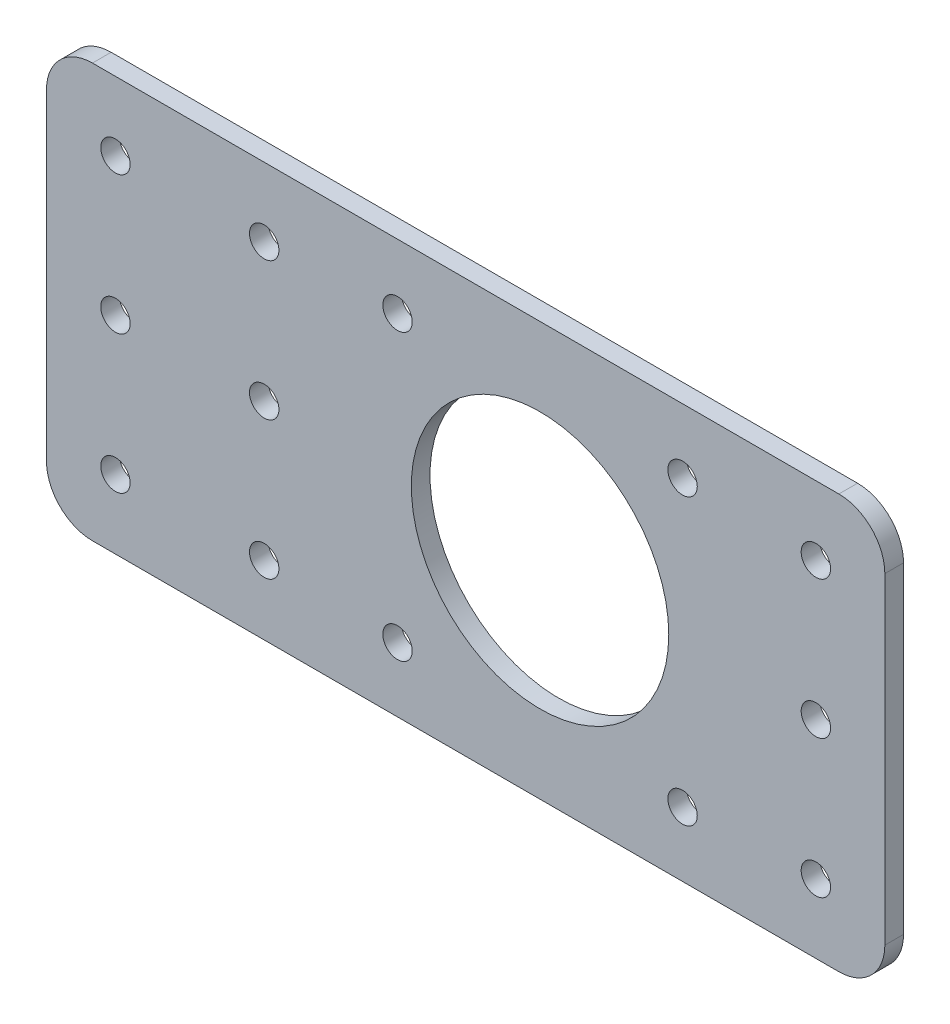
ISO-10303-21;
HEADER;
FILE_DESCRIPTION(('STEP AP214'),'2;1');
FILE_NAME('part.step','',(''),(''),'','','');
FILE_SCHEMA(('AUTOMOTIVE_DESIGN { 1 0 10303 214 1 1 1 1 }'));
ENDSEC;
DATA;
#1=APPLICATION_CONTEXT('core data for automotive mechanical design processes');
#2=APPLICATION_PROTOCOL_DEFINITION('international standard','automotive_design',2000,#1);
#3=PRODUCT_CONTEXT('',#1,'mechanical');
#4=PRODUCT('Part','Part','',(#3));
#5=PRODUCT_RELATED_PRODUCT_CATEGORY('part','',(#4));
#6=PRODUCT_DEFINITION_FORMATION('','',#4);
#7=PRODUCT_DEFINITION_CONTEXT('part definition',#1,'design');
#8=PRODUCT_DEFINITION('design','',#6,#7);
#9=PRODUCT_DEFINITION_SHAPE('','',#8);
#10=(LENGTH_UNIT() NAMED_UNIT(*) SI_UNIT(.MILLI.,.METRE.));
#11=(NAMED_UNIT(*) PLANE_ANGLE_UNIT() SI_UNIT($,.RADIAN.));
#12=(NAMED_UNIT(*) SI_UNIT($,.STERADIAN.) SOLID_ANGLE_UNIT());
#13=UNCERTAINTY_MEASURE_WITH_UNIT(LENGTH_MEASURE(1.E-05),#10,'distance_accuracy_value','');
#14=(GEOMETRIC_REPRESENTATION_CONTEXT(3) GLOBAL_UNCERTAINTY_ASSIGNED_CONTEXT((#13)) GLOBAL_UNIT_ASSIGNED_CONTEXT((#10,
#11,#12)) REPRESENTATION_CONTEXT('',''));
#15=CARTESIAN_POINT('',(0.,0.,0.));
#16=DIRECTION('',(0.,0.,1.));
#17=DIRECTION('',(1.,0.,0.));
#18=AXIS2_PLACEMENT_3D('',#15,#16,#17);
#19=CARTESIAN_POINT('',(0.,0.,2.032));
#20=DIRECTION('',(0.,0.,-1.));
#21=DIRECTION('',(-1.,0.,0.));
#22=AXIS2_PLACEMENT_3D('',#19,#20,#21);
#23=PLANE('',#22);
#24=CARTESIAN_POINT('',(-46.18,-15.,2.032));
#25=DIRECTION('',(0.,0.,1.));
#26=DIRECTION('',(1.,0.,0.));
#27=AXIS2_PLACEMENT_3D('',#24,#25,#26);
#28=CIRCLE('',#27,1.6);
#29=CARTESIAN_POINT('',(-44.58,-15.,2.032));
#30=VERTEX_POINT('',#29);
#31=EDGE_CURVE('E255',#30,#30,#28,.T.);
#32=ORIENTED_EDGE('',*,*,#31,.F.);
#33=EDGE_LOOP('',(#32));
#34=FACE_BOUND('',#33,.T.);
#35=CARTESIAN_POINT('',(-46.18,0.,2.032));
#36=DIRECTION('',(0.,0.,1.));
#37=DIRECTION('',(1.,0.,0.));
#38=AXIS2_PLACEMENT_3D('',#35,#36,#37);
#39=CIRCLE('',#38,1.6);
#40=CARTESIAN_POINT('',(-44.58,0.,2.032));
#41=VERTEX_POINT('',#40);
#42=EDGE_CURVE('E249',#41,#41,#39,.T.);
#43=ORIENTED_EDGE('',*,*,#42,.F.);
#44=EDGE_LOOP('',(#43));
#45=FACE_BOUND('',#44,.T.);
#46=CARTESIAN_POINT('',(-46.18,15.,2.032));
#47=DIRECTION('',(0.,0.,1.));
#48=DIRECTION('',(1.,0.,0.));
#49=AXIS2_PLACEMENT_3D('',#46,#47,#48);
#50=CIRCLE('',#49,1.6);
#51=CARTESIAN_POINT('',(-44.58,15.,2.032));
#52=VERTEX_POINT('',#51);
#53=EDGE_CURVE('E243',#52,#52,#50,.T.);
#54=ORIENTED_EDGE('',*,*,#53,.F.);
#55=EDGE_LOOP('',(#54));
#56=FACE_BOUND('',#55,.T.);
#57=CARTESIAN_POINT('',(30.,0.,2.032));
#58=DIRECTION('',(0.,0.,1.));
#59=DIRECTION('',(-1.,0.,0.));
#60=AXIS2_PLACEMENT_3D('',#57,#58,#59);
#61=CIRCLE('',#60,1.60000000000001);
#62=CARTESIAN_POINT('',(28.4,0.,2.032));
#63=VERTEX_POINT('',#62);
#64=EDGE_CURVE('E164',#63,#63,#61,.T.);
#65=ORIENTED_EDGE('',*,*,#64,.F.);
#66=EDGE_LOOP('',(#65));
#67=FACE_BOUND('',#66,.T.);
#68=CARTESIAN_POINT('',(30.,15.,2.032));
#69=DIRECTION('',(0.,0.,1.));
#70=DIRECTION('',(-1.,0.,0.));
#71=AXIS2_PLACEMENT_3D('',#68,#69,#70);
#72=CIRCLE('',#71,1.6);
#73=CARTESIAN_POINT('',(28.4,15.,2.032));
#74=VERTEX_POINT('',#73);
#75=EDGE_CURVE('E231',#74,#74,#72,.T.);
#76=ORIENTED_EDGE('',*,*,#75,.F.);
#77=EDGE_LOOP('',(#76));
#78=FACE_BOUND('',#77,.T.);
#79=CARTESIAN_POINT('',(30.,-15.,2.032));
#80=DIRECTION('',(0.,0.,1.));
#81=DIRECTION('',(1.,0.,0.));
#82=AXIS2_PLACEMENT_3D('',#79,#80,#81);
#83=CIRCLE('',#82,1.60000000000001);
#84=CARTESIAN_POINT('',(31.6,-15.,2.032));
#85=VERTEX_POINT('',#84);
#86=EDGE_CURVE('E225',#85,#85,#83,.T.);
#87=ORIENTED_EDGE('',*,*,#86,.F.);
#88=EDGE_LOOP('',(#87));
#89=FACE_BOUND('',#88,.T.);
#90=CARTESIAN_POINT('',(-30.,-15.,2.032));
#91=DIRECTION('',(0.,0.,1.));
#92=DIRECTION('',(-1.,0.,0.));
#93=AXIS2_PLACEMENT_3D('',#90,#91,#92);
#94=CIRCLE('',#93,1.6);
#95=CARTESIAN_POINT('',(-31.6,-15.,2.032));
#96=VERTEX_POINT('',#95);
#97=EDGE_CURVE('E219',#96,#96,#94,.T.);
#98=ORIENTED_EDGE('',*,*,#97,.F.);
#99=EDGE_LOOP('',(#98));
#100=FACE_BOUND('',#99,.T.);
#101=CARTESIAN_POINT('',(-30.,15.,2.032));
#102=DIRECTION('',(0.,0.,1.));
#103=DIRECTION('',(1.,0.,0.));
#104=AXIS2_PLACEMENT_3D('',#101,#102,#103);
#105=CIRCLE('',#104,1.6);
#106=CARTESIAN_POINT('',(-28.4,15.,2.032));
#107=VERTEX_POINT('',#106);
#108=EDGE_CURVE('E213',#107,#107,#105,.T.);
#109=ORIENTED_EDGE('',*,*,#108,.F.);
#110=EDGE_LOOP('',(#109));
#111=FACE_BOUND('',#110,.T.);
#112=CARTESIAN_POINT('',(-30.,0.,2.032));
#113=DIRECTION('',(0.,0.,1.));
#114=DIRECTION('',(1.,0.,0.));
#115=AXIS2_PLACEMENT_3D('',#112,#113,#114);
#116=CIRCLE('',#115,1.60000000000001);
#117=CARTESIAN_POINT('',(-28.4,0.,2.032));
#118=VERTEX_POINT('',#117);
#119=EDGE_CURVE('E207',#118,#118,#116,.T.);
#120=ORIENTED_EDGE('',*,*,#119,.F.);
#121=EDGE_LOOP('',(#120));
#122=FACE_BOUND('',#121,.T.);
#123=CARTESIAN_POINT('',(15.5,-15.5,2.032));
#124=DIRECTION('',(0.,0.,1.));
#125=DIRECTION('',(1.,0.,0.));
#126=AXIS2_PLACEMENT_3D('',#123,#124,#125);
#127=CIRCLE('',#126,1.6);
#128=CARTESIAN_POINT('',(17.1,-15.5,2.032));
#129=VERTEX_POINT('',#128);
#130=EDGE_CURVE('E192',#129,#129,#127,.T.);
#131=ORIENTED_EDGE('',*,*,#130,.F.);
#132=EDGE_LOOP('',(#131));
#133=FACE_BOUND('',#132,.T.);
#134=CARTESIAN_POINT('',(-15.5,15.5,2.032));
#135=DIRECTION('',(0.,0.,1.));
#136=DIRECTION('',(1.,0.,0.));
#137=AXIS2_PLACEMENT_3D('',#134,#135,#136);
#138=CIRCLE('',#137,1.6);
#139=CARTESIAN_POINT('',(-13.9,15.5,2.032));
#140=VERTEX_POINT('',#139);
#141=EDGE_CURVE('E180',#140,#140,#138,.T.);
#142=ORIENTED_EDGE('',*,*,#141,.F.);
#143=EDGE_LOOP('',(#142));
#144=FACE_BOUND('',#143,.T.);
#145=DIRECTION('',(0.,-1.,0.));
#146=VECTOR('',#145,1.);
#147=CARTESIAN_POINT('',(-53.68,22.5,2.032));
#148=LINE('',#147,#146);
#149=CARTESIAN_POINT('',(-53.68,17.5,2.032));
#150=VERTEX_POINT('',#149);
#151=CARTESIAN_POINT('',(-53.68,-17.5,2.032));
#152=VERTEX_POINT('',#151);
#153=EDGE_CURVE('E165',#150,#152,#148,.T.);
#154=ORIENTED_EDGE('',*,*,#153,.T.);
#155=CARTESIAN_POINT('',(-48.68,-17.5,2.032));
#156=DIRECTION('',(0.,0.,-1.));
#157=DIRECTION('',(-1.,0.,0.));
#158=AXIS2_PLACEMENT_3D('',#155,#156,#157);
#159=CIRCLE('',#158,5.);
#160=CARTESIAN_POINT('',(-48.68,-22.5,2.032));
#161=VERTEX_POINT('',#160);
#162=EDGE_CURVE('E151',#152,#161,#159,.F.);
#163=ORIENTED_EDGE('',*,*,#162,.T.);
#164=DIRECTION('',(1.,0.,0.));
#165=VECTOR('',#164,1.);
#166=CARTESIAN_POINT('',(-37.5,-22.5,2.032));
#167=LINE('',#166,#165);
#168=CARTESIAN_POINT('',(32.5,-22.5,2.032));
#169=VERTEX_POINT('',#168);
#170=EDGE_CURVE('E119',#161,#169,#167,.T.);
#171=ORIENTED_EDGE('',*,*,#170,.T.);
#172=CARTESIAN_POINT('',(32.5,-17.5,2.032));
#173=DIRECTION('',(0.,0.,-1.));
#174=DIRECTION('',(-1.,0.,0.));
#175=AXIS2_PLACEMENT_3D('',#172,#173,#174);
#176=CIRCLE('',#175,5.);
#177=CARTESIAN_POINT('',(37.5,-17.5,2.032));
#178=VERTEX_POINT('',#177);
#179=EDGE_CURVE('E137',#169,#178,#176,.F.);
#180=ORIENTED_EDGE('',*,*,#179,.T.);
#181=DIRECTION('',(0.,1.,0.));
#182=VECTOR('',#181,1.);
#183=CARTESIAN_POINT('',(37.5,-22.5,2.032));
#184=LINE('',#183,#182);
#185=CARTESIAN_POINT('',(37.5,17.5,2.032));
#186=VERTEX_POINT('',#185);
#187=EDGE_CURVE('E126',#178,#186,#184,.T.);
#188=ORIENTED_EDGE('',*,*,#187,.T.);
#189=CARTESIAN_POINT('',(32.5,17.5,2.032));
#190=DIRECTION('',(0.,0.,-1.));
#191=DIRECTION('',(-1.,0.,0.));
#192=AXIS2_PLACEMENT_3D('',#189,#190,#191);
#193=CIRCLE('',#192,5.);
#194=CARTESIAN_POINT('',(32.5,22.5,2.032));
#195=VERTEX_POINT('',#194);
#196=EDGE_CURVE('E139',#186,#195,#193,.F.);
#197=ORIENTED_EDGE('',*,*,#196,.T.);
#198=DIRECTION('',(-1.,0.,0.));
#199=VECTOR('',#198,1.);
#200=CARTESIAN_POINT('',(-37.5,22.5,2.032));
#201=LINE('',#200,#199);
#202=CARTESIAN_POINT('',(-48.68,22.5,2.032));
#203=VERTEX_POINT('',#202);
#204=EDGE_CURVE('E118',#195,#203,#201,.T.);
#205=ORIENTED_EDGE('',*,*,#204,.T.);
#206=CARTESIAN_POINT('',(-48.68,17.5,2.032));
#207=DIRECTION('',(0.,0.,-1.));
#208=DIRECTION('',(-1.,0.,0.));
#209=AXIS2_PLACEMENT_3D('',#206,#207,#208);
#210=CIRCLE('',#209,5.);
#211=EDGE_CURVE('E149',#203,#150,#210,.F.);
#212=ORIENTED_EDGE('',*,*,#211,.T.);
#213=EDGE_LOOP('',(#154,#163,#171,#180,#188,#197,#205,#212));
#214=FACE_BOUND('',#213,.T.);
#215=CARTESIAN_POINT('',(0.,0.,2.032));
#216=DIRECTION('',(0.,0.,1.));
#217=DIRECTION('',(1.,0.,0.));
#218=AXIS2_PLACEMENT_3D('',#215,#216,#217);
#219=CIRCLE('',#218,14.);
#220=CARTESIAN_POINT('',(14.,0.,2.032));
#221=VERTEX_POINT('',#220);
#222=EDGE_CURVE('E128',#221,#221,#219,.T.);
#223=ORIENTED_EDGE('',*,*,#222,.F.);
#224=EDGE_LOOP('',(#223));
#225=FACE_BOUND('',#224,.T.);
#226=CARTESIAN_POINT('',(15.5,15.5,2.032));
#227=DIRECTION('',(0.,0.,1.));
#228=DIRECTION('',(1.,0.,0.));
#229=AXIS2_PLACEMENT_3D('',#226,#227,#228);
#230=CIRCLE('',#229,1.6);
#231=CARTESIAN_POINT('',(17.1,15.5,2.032));
#232=VERTEX_POINT('',#231);
#233=EDGE_CURVE('E186',#232,#232,#230,.T.);
#234=ORIENTED_EDGE('',*,*,#233,.F.);
#235=EDGE_LOOP('',(#234));
#236=FACE_BOUND('',#235,.T.);
#237=CARTESIAN_POINT('',(-15.5,-15.5,2.032));
#238=DIRECTION('',(0.,0.,1.));
#239=DIRECTION('',(1.,0.,0.));
#240=AXIS2_PLACEMENT_3D('',#237,#238,#239);
#241=CIRCLE('',#240,1.6);
#242=CARTESIAN_POINT('',(-13.9,-15.5,2.032));
#243=VERTEX_POINT('',#242);
#244=EDGE_CURVE('E198',#243,#243,#241,.T.);
#245=ORIENTED_EDGE('',*,*,#244,.F.);
#246=EDGE_LOOP('',(#245));
#247=FACE_BOUND('',#246,.T.);
#248=ADVANCED_FACE('F33',(#34,#45,#56,#67,#78,#89,#100,#111,#122,#133,#144,#214,#225,#236,#247),
#23,.F.);
#249=CARTESIAN_POINT('',(0.,0.,0.));
#250=DIRECTION('',(0.,0.,-1.));
#251=DIRECTION('',(-1.,0.,0.));
#252=AXIS2_PLACEMENT_3D('',#249,#250,#251);
#253=PLANE('',#252);
#254=CARTESIAN_POINT('',(-46.18,-15.,0.));
#255=DIRECTION('',(0.,0.,1.));
#256=DIRECTION('',(1.,0.,0.));
#257=AXIS2_PLACEMENT_3D('',#254,#255,#256);
#258=CIRCLE('',#257,1.6);
#259=CARTESIAN_POINT('',(-44.58,-15.,0.));
#260=VERTEX_POINT('',#259);
#261=EDGE_CURVE('E252',#260,#260,#258,.T.);
#262=ORIENTED_EDGE('',*,*,#261,.T.);
#263=EDGE_LOOP('',(#262));
#264=FACE_BOUND('',#263,.T.);
#265=CARTESIAN_POINT('',(-46.18,0.,0.));
#266=DIRECTION('',(0.,0.,1.));
#267=DIRECTION('',(1.,0.,0.));
#268=AXIS2_PLACEMENT_3D('',#265,#266,#267);
#269=CIRCLE('',#268,1.6);
#270=CARTESIAN_POINT('',(-44.58,0.,0.));
#271=VERTEX_POINT('',#270);
#272=EDGE_CURVE('E246',#271,#271,#269,.T.);
#273=ORIENTED_EDGE('',*,*,#272,.T.);
#274=EDGE_LOOP('',(#273));
#275=FACE_BOUND('',#274,.T.);
#276=CARTESIAN_POINT('',(-46.18,15.,0.));
#277=DIRECTION('',(0.,0.,1.));
#278=DIRECTION('',(1.,0.,0.));
#279=AXIS2_PLACEMENT_3D('',#276,#277,#278);
#280=CIRCLE('',#279,1.6);
#281=CARTESIAN_POINT('',(-44.58,15.,0.));
#282=VERTEX_POINT('',#281);
#283=EDGE_CURVE('E242',#282,#282,#280,.T.);
#284=ORIENTED_EDGE('',*,*,#283,.T.);
#285=EDGE_LOOP('',(#284));
#286=FACE_BOUND('',#285,.T.);
#287=DIRECTION('',(1.,0.,0.));
#288=VECTOR('',#287,1.);
#289=CARTESIAN_POINT('',(-37.5,-22.5,0.));
#290=LINE('',#289,#288);
#291=CARTESIAN_POINT('',(-48.68,-22.5,0.));
#292=VERTEX_POINT('',#291);
#293=CARTESIAN_POINT('',(32.5,-22.5,0.));
#294=VERTEX_POINT('',#293);
#295=EDGE_CURVE('E123',#292,#294,#290,.T.);
#296=ORIENTED_EDGE('',*,*,#295,.F.);
#297=CARTESIAN_POINT('',(-48.68,-17.5,0.));
#298=DIRECTION('',(0.,0.,-1.));
#299=DIRECTION('',(-1.,0.,0.));
#300=AXIS2_PLACEMENT_3D('',#297,#298,#299);
#301=CIRCLE('',#300,5.);
#302=CARTESIAN_POINT('',(-53.68,-17.5,0.));
#303=VERTEX_POINT('',#302);
#304=EDGE_CURVE('E41',#292,#303,#301,.T.);
#305=ORIENTED_EDGE('',*,*,#304,.T.);
#306=DIRECTION('',(0.,-1.,0.));
#307=VECTOR('',#306,1.);
#308=CARTESIAN_POINT('',(-53.68,22.5,0.));
#309=LINE('',#308,#307);
#310=CARTESIAN_POINT('',(-53.68,17.5,0.));
#311=VERTEX_POINT('',#310);
#312=EDGE_CURVE('E156',#311,#303,#309,.T.);
#313=ORIENTED_EDGE('',*,*,#312,.F.);
#314=CARTESIAN_POINT('',(-48.68,17.5,0.));
#315=DIRECTION('',(0.,0.,-1.));
#316=DIRECTION('',(-1.,0.,0.));
#317=AXIS2_PLACEMENT_3D('',#314,#315,#316);
#318=CIRCLE('',#317,5.);
#319=CARTESIAN_POINT('',(-48.68,22.5,0.));
#320=VERTEX_POINT('',#319);
#321=EDGE_CURVE('E48',#311,#320,#318,.T.);
#322=ORIENTED_EDGE('',*,*,#321,.T.);
#323=DIRECTION('',(-1.,0.,0.));
#324=VECTOR('',#323,1.);
#325=CARTESIAN_POINT('',(-37.5,22.5,0.));
#326=LINE('',#325,#324);
#327=CARTESIAN_POINT('',(32.5,22.5,0.));
#328=VERTEX_POINT('',#327);
#329=EDGE_CURVE('E115',#328,#320,#326,.T.);
#330=ORIENTED_EDGE('',*,*,#329,.F.);
#331=CARTESIAN_POINT('',(32.5,17.5,0.));
#332=DIRECTION('',(0.,0.,-1.));
#333=DIRECTION('',(-1.,0.,0.));
#334=AXIS2_PLACEMENT_3D('',#331,#332,#333);
#335=CIRCLE('',#334,5.);
#336=CARTESIAN_POINT('',(37.5,17.5,0.));
#337=VERTEX_POINT('',#336);
#338=EDGE_CURVE('E101',#328,#337,#335,.T.);
#339=ORIENTED_EDGE('',*,*,#338,.T.);
#340=DIRECTION('',(0.,1.,0.));
#341=VECTOR('',#340,1.);
#342=CARTESIAN_POINT('',(37.5,-22.5,0.));
#343=LINE('',#342,#341);
#344=CARTESIAN_POINT('',(37.5,-17.5,0.));
#345=VERTEX_POINT('',#344);
#346=EDGE_CURVE('E124',#345,#337,#343,.T.);
#347=ORIENTED_EDGE('',*,*,#346,.F.);
#348=CARTESIAN_POINT('',(32.5,-17.5,0.));
#349=DIRECTION('',(0.,0.,-1.));
#350=DIRECTION('',(-1.,0.,0.));
#351=AXIS2_PLACEMENT_3D('',#348,#349,#350);
#352=CIRCLE('',#351,5.);
#353=EDGE_CURVE('E110',#345,#294,#352,.T.);
#354=ORIENTED_EDGE('',*,*,#353,.T.);
#355=EDGE_LOOP('',(#296,#305,#313,#322,#330,#339,#347,#354));
#356=FACE_BOUND('',#355,.T.);
#357=CARTESIAN_POINT('',(30.,0.,0.));
#358=DIRECTION('',(0.,0.,1.));
#359=DIRECTION('',(-1.,0.,0.));
#360=AXIS2_PLACEMENT_3D('',#357,#358,#359);
#361=CIRCLE('',#360,1.60000000000001);
#362=CARTESIAN_POINT('',(28.4,0.,0.));
#363=VERTEX_POINT('',#362);
#364=EDGE_CURVE('E234',#363,#363,#361,.T.);
#365=ORIENTED_EDGE('',*,*,#364,.T.);
#366=EDGE_LOOP('',(#365));
#367=FACE_BOUND('',#366,.T.);
#368=CARTESIAN_POINT('',(30.,15.,0.));
#369=DIRECTION('',(0.,0.,1.));
#370=DIRECTION('',(-1.,0.,0.));
#371=AXIS2_PLACEMENT_3D('',#368,#369,#370);
#372=CIRCLE('',#371,1.6);
#373=CARTESIAN_POINT('',(28.4,15.,0.));
#374=VERTEX_POINT('',#373);
#375=EDGE_CURVE('E228',#374,#374,#372,.T.);
#376=ORIENTED_EDGE('',*,*,#375,.T.);
#377=EDGE_LOOP('',(#376));
#378=FACE_BOUND('',#377,.T.);
#379=CARTESIAN_POINT('',(30.,-15.,0.));
#380=DIRECTION('',(0.,0.,1.));
#381=DIRECTION('',(1.,0.,0.));
#382=AXIS2_PLACEMENT_3D('',#379,#380,#381);
#383=CIRCLE('',#382,1.60000000000001);
#384=CARTESIAN_POINT('',(31.6,-15.,0.));
#385=VERTEX_POINT('',#384);
#386=EDGE_CURVE('E222',#385,#385,#383,.T.);
#387=ORIENTED_EDGE('',*,*,#386,.T.);
#388=EDGE_LOOP('',(#387));
#389=FACE_BOUND('',#388,.T.);
#390=CARTESIAN_POINT('',(-30.,-15.,0.));
#391=DIRECTION('',(0.,0.,1.));
#392=DIRECTION('',(-1.,0.,0.));
#393=AXIS2_PLACEMENT_3D('',#390,#391,#392);
#394=CIRCLE('',#393,1.6);
#395=CARTESIAN_POINT('',(-31.6,-15.,0.));
#396=VERTEX_POINT('',#395);
#397=EDGE_CURVE('E216',#396,#396,#394,.T.);
#398=ORIENTED_EDGE('',*,*,#397,.T.);
#399=EDGE_LOOP('',(#398));
#400=FACE_BOUND('',#399,.T.);
#401=CARTESIAN_POINT('',(-30.,15.,0.));
#402=DIRECTION('',(0.,0.,1.));
#403=DIRECTION('',(1.,0.,0.));
#404=AXIS2_PLACEMENT_3D('',#401,#402,#403);
#405=CIRCLE('',#404,1.6);
#406=CARTESIAN_POINT('',(-28.4,15.,0.));
#407=VERTEX_POINT('',#406);
#408=EDGE_CURVE('E210',#407,#407,#405,.T.);
#409=ORIENTED_EDGE('',*,*,#408,.T.);
#410=EDGE_LOOP('',(#409));
#411=FACE_BOUND('',#410,.T.);
#412=CARTESIAN_POINT('',(-30.,0.,0.));
#413=DIRECTION('',(0.,0.,1.));
#414=DIRECTION('',(1.,0.,0.));
#415=AXIS2_PLACEMENT_3D('',#412,#413,#414);
#416=CIRCLE('',#415,1.60000000000001);
#417=CARTESIAN_POINT('',(-28.4,0.,0.));
#418=VERTEX_POINT('',#417);
#419=EDGE_CURVE('E204',#418,#418,#416,.T.);
#420=ORIENTED_EDGE('',*,*,#419,.T.);
#421=EDGE_LOOP('',(#420));
#422=FACE_BOUND('',#421,.T.);
#423=CARTESIAN_POINT('',(15.5,-15.5,0.));
#424=DIRECTION('',(0.,0.,1.));
#425=DIRECTION('',(1.,0.,0.));
#426=AXIS2_PLACEMENT_3D('',#423,#424,#425);
#427=CIRCLE('',#426,1.6);
#428=CARTESIAN_POINT('',(17.1,-15.5,0.));
#429=VERTEX_POINT('',#428);
#430=EDGE_CURVE('E195',#429,#429,#427,.T.);
#431=ORIENTED_EDGE('',*,*,#430,.T.);
#432=EDGE_LOOP('',(#431));
#433=FACE_BOUND('',#432,.T.);
#434=CARTESIAN_POINT('',(-15.5,15.5,0.));
#435=DIRECTION('',(0.,0.,1.));
#436=DIRECTION('',(1.,0.,0.));
#437=AXIS2_PLACEMENT_3D('',#434,#435,#436);
#438=CIRCLE('',#437,1.6);
#439=CARTESIAN_POINT('',(-13.9,15.5,0.));
#440=VERTEX_POINT('',#439);
#441=EDGE_CURVE('E183',#440,#440,#438,.T.);
#442=ORIENTED_EDGE('',*,*,#441,.T.);
#443=EDGE_LOOP('',(#442));
#444=FACE_BOUND('',#443,.T.);
#445=CARTESIAN_POINT('',(0.,0.,0.));
#446=DIRECTION('',(0.,0.,1.));
#447=DIRECTION('',(1.,0.,0.));
#448=AXIS2_PLACEMENT_3D('',#445,#446,#447);
#449=CIRCLE('',#448,14.);
#450=CARTESIAN_POINT('',(14.,0.,0.));
#451=VERTEX_POINT('',#450);
#452=EDGE_CURVE('E177',#451,#451,#449,.T.);
#453=ORIENTED_EDGE('',*,*,#452,.T.);
#454=EDGE_LOOP('',(#453));
#455=FACE_BOUND('',#454,.T.);
#456=CARTESIAN_POINT('',(15.5,15.5,0.));
#457=DIRECTION('',(0.,0.,1.));
#458=DIRECTION('',(1.,0.,0.));
#459=AXIS2_PLACEMENT_3D('',#456,#457,#458);
#460=CIRCLE('',#459,1.6);
#461=CARTESIAN_POINT('',(17.1,15.5,0.));
#462=VERTEX_POINT('',#461);
#463=EDGE_CURVE('E189',#462,#462,#460,.T.);
#464=ORIENTED_EDGE('',*,*,#463,.T.);
#465=EDGE_LOOP('',(#464));
#466=FACE_BOUND('',#465,.T.);
#467=CARTESIAN_POINT('',(-15.5,-15.5,0.));
#468=DIRECTION('',(0.,0.,1.));
#469=DIRECTION('',(1.,0.,0.));
#470=AXIS2_PLACEMENT_3D('',#467,#468,#469);
#471=CIRCLE('',#470,1.6);
#472=CARTESIAN_POINT('',(-13.9,-15.5,0.));
#473=VERTEX_POINT('',#472);
#474=EDGE_CURVE('E201',#473,#473,#471,.T.);
#475=ORIENTED_EDGE('',*,*,#474,.T.);
#476=EDGE_LOOP('',(#475));
#477=FACE_BOUND('',#476,.T.);
#478=ADVANCED_FACE('F121',(#264,#275,#286,#356,#367,#378,#389,#400,#411,#422,#433,#444,#455,
#466,#477),#253,.T.);
#479=CARTESIAN_POINT('',(37.5,-22.5,2.032));
#480=DIRECTION('',(-1.,0.,0.));
#481=DIRECTION('',(0.,0.,1.));
#482=AXIS2_PLACEMENT_3D('',#479,#480,#481);
#483=PLANE('',#482);
#484=ORIENTED_EDGE('',*,*,#346,.T.);
#485=DIRECTION('',(0.,0.,-1.));
#486=VECTOR('',#485,1.);
#487=CARTESIAN_POINT('',(37.5,17.5,2.032));
#488=LINE('',#487,#486);
#489=EDGE_CURVE('E106',#337,#186,#488,.F.);
#490=ORIENTED_EDGE('',*,*,#489,.T.);
#491=ORIENTED_EDGE('',*,*,#187,.F.);
#492=DIRECTION('',(0.,0.,-1.));
#493=VECTOR('',#492,1.);
#494=CARTESIAN_POINT('',(37.5,-17.5,2.032));
#495=LINE('',#494,#493);
#496=EDGE_CURVE('E109',#178,#345,#495,.T.);
#497=ORIENTED_EDGE('',*,*,#496,.T.);
#498=EDGE_LOOP('',(#484,#490,#491,#497));
#499=FACE_BOUND('',#498,.T.);
#500=ADVANCED_FACE('F303',(#499),#483,.F.);
#501=CARTESIAN_POINT('',(-37.5,22.5,2.032));
#502=DIRECTION('',(0.,-1.,0.));
#503=DIRECTION('',(0.,0.,-1.));
#504=AXIS2_PLACEMENT_3D('',#501,#502,#503);
#505=PLANE('',#504);
#506=ORIENTED_EDGE('',*,*,#329,.T.);
#507=DIRECTION('',(0.,0.,1.));
#508=VECTOR('',#507,1.);
#509=CARTESIAN_POINT('',(-48.68,22.5,2.032));
#510=LINE('',#509,#508);
#511=EDGE_CURVE('E11',#320,#203,#510,.T.);
#512=ORIENTED_EDGE('',*,*,#511,.T.);
#513=ORIENTED_EDGE('',*,*,#204,.F.);
#514=DIRECTION('',(0.,0.,-1.));
#515=VECTOR('',#514,1.);
#516=CARTESIAN_POINT('',(32.5,22.5,2.032));
#517=LINE('',#516,#515);
#518=EDGE_CURVE('E105',#195,#328,#517,.T.);
#519=ORIENTED_EDGE('',*,*,#518,.T.);
#520=EDGE_LOOP('',(#506,#512,#513,#519));
#521=FACE_BOUND('',#520,.T.);
#522=ADVANCED_FACE('F114',(#521),#505,.F.);
#523=CARTESIAN_POINT('',(-37.5,-22.5,2.032));
#524=DIRECTION('',(0.,1.,0.));
#525=DIRECTION('',(0.,0.,1.));
#526=AXIS2_PLACEMENT_3D('',#523,#524,#525);
#527=PLANE('',#526);
#528=ORIENTED_EDGE('',*,*,#170,.F.);
#529=DIRECTION('',(0.,0.,1.));
#530=VECTOR('',#529,1.);
#531=CARTESIAN_POINT('',(-48.68,-22.5,0.));
#532=LINE('',#531,#530);
#533=EDGE_CURVE('E56',#161,#292,#532,.F.);
#534=ORIENTED_EDGE('',*,*,#533,.T.);
#535=ORIENTED_EDGE('',*,*,#295,.T.);
#536=DIRECTION('',(0.,0.,-1.));
#537=VECTOR('',#536,1.);
#538=CARTESIAN_POINT('',(32.5,-22.5,2.032));
#539=LINE('',#538,#537);
#540=EDGE_CURVE('E141',#294,#169,#539,.F.);
#541=ORIENTED_EDGE('',*,*,#540,.T.);
#542=EDGE_LOOP('',(#528,#534,#535,#541));
#543=FACE_BOUND('',#542,.T.);
#544=ADVANCED_FACE('F170',(#543),#527,.F.);
#545=CARTESIAN_POINT('',(0.,0.,2.032));
#546=DIRECTION('',(0.,0.,-1.));
#547=DIRECTION('',(-1.,0.,0.));
#548=AXIS2_PLACEMENT_3D('',#545,#546,#547);
#549=CYLINDRICAL_SURFACE('',#548,14.);
#550=ORIENTED_EDGE('',*,*,#222,.T.);
#551=EDGE_LOOP('',(#550));
#552=FACE_BOUND('',#551,.T.);
#553=ORIENTED_EDGE('',*,*,#452,.F.);
#554=EDGE_LOOP('',(#553));
#555=FACE_BOUND('',#554,.T.);
#556=ADVANCED_FACE('F297',(#552,#555),#549,.F.);
#557=CARTESIAN_POINT('',(-15.5,15.5,2.032));
#558=DIRECTION('',(0.,0.,-1.));
#559=DIRECTION('',(-1.,0.,0.));
#560=AXIS2_PLACEMENT_3D('',#557,#558,#559);
#561=CYLINDRICAL_SURFACE('',#560,1.6);
#562=ORIENTED_EDGE('',*,*,#141,.T.);
#563=EDGE_LOOP('',(#562));
#564=FACE_BOUND('',#563,.T.);
#565=ORIENTED_EDGE('',*,*,#441,.F.);
#566=EDGE_LOOP('',(#565));
#567=FACE_BOUND('',#566,.T.);
#568=ADVANCED_FACE('F293',(#564,#567),#561,.F.);
#569=CARTESIAN_POINT('',(15.5,15.5,2.032));
#570=DIRECTION('',(0.,0.,-1.));
#571=DIRECTION('',(-1.,0.,0.));
#572=AXIS2_PLACEMENT_3D('',#569,#570,#571);
#573=CYLINDRICAL_SURFACE('',#572,1.6);
#574=ORIENTED_EDGE('',*,*,#233,.T.);
#575=EDGE_LOOP('',(#574));
#576=FACE_BOUND('',#575,.T.);
#577=ORIENTED_EDGE('',*,*,#463,.F.);
#578=EDGE_LOOP('',(#577));
#579=FACE_BOUND('',#578,.T.);
#580=ADVANCED_FACE('F296',(#576,#579),#573,.F.);
#581=CARTESIAN_POINT('',(15.5,-15.5,2.032));
#582=DIRECTION('',(0.,0.,-1.));
#583=DIRECTION('',(-1.,0.,0.));
#584=AXIS2_PLACEMENT_3D('',#581,#582,#583);
#585=CYLINDRICAL_SURFACE('',#584,1.6);
#586=ORIENTED_EDGE('',*,*,#130,.T.);
#587=EDGE_LOOP('',(#586));
#588=FACE_BOUND('',#587,.T.);
#589=ORIENTED_EDGE('',*,*,#430,.F.);
#590=EDGE_LOOP('',(#589));
#591=FACE_BOUND('',#590,.T.);
#592=ADVANCED_FACE('F313',(#588,#591),#585,.F.);
#593=CARTESIAN_POINT('',(-15.5,-15.5,2.032));
#594=DIRECTION('',(0.,0.,-1.));
#595=DIRECTION('',(-1.,0.,0.));
#596=AXIS2_PLACEMENT_3D('',#593,#594,#595);
#597=CYLINDRICAL_SURFACE('',#596,1.6);
#598=ORIENTED_EDGE('',*,*,#244,.T.);
#599=EDGE_LOOP('',(#598));
#600=FACE_BOUND('',#599,.T.);
#601=ORIENTED_EDGE('',*,*,#474,.F.);
#602=EDGE_LOOP('',(#601));
#603=FACE_BOUND('',#602,.T.);
#604=ADVANCED_FACE('F311',(#600,#603),#597,.F.);
#605=CARTESIAN_POINT('',(32.5,17.5,2.032));
#606=DIRECTION('',(0.,0.,-1.));
#607=DIRECTION('',(-1.,0.,0.));
#608=AXIS2_PLACEMENT_3D('',#605,#606,#607);
#609=CYLINDRICAL_SURFACE('',#608,5.);
#610=ORIENTED_EDGE('',*,*,#196,.F.);
#611=ORIENTED_EDGE('',*,*,#489,.F.);
#612=ORIENTED_EDGE('',*,*,#338,.F.);
#613=ORIENTED_EDGE('',*,*,#518,.F.);
#614=EDGE_LOOP('',(#610,#611,#612,#613));
#615=FACE_BOUND('',#614,.T.);
#616=ADVANCED_FACE('F104',(#615),#609,.T.);
#617=CARTESIAN_POINT('',(32.5,-17.5,2.032));
#618=DIRECTION('',(0.,0.,-1.));
#619=DIRECTION('',(-1.,0.,0.));
#620=AXIS2_PLACEMENT_3D('',#617,#618,#619);
#621=CYLINDRICAL_SURFACE('',#620,5.);
#622=ORIENTED_EDGE('',*,*,#179,.F.);
#623=ORIENTED_EDGE('',*,*,#540,.F.);
#624=ORIENTED_EDGE('',*,*,#353,.F.);
#625=ORIENTED_EDGE('',*,*,#496,.F.);
#626=EDGE_LOOP('',(#622,#623,#624,#625));
#627=FACE_BOUND('',#626,.T.);
#628=ADVANCED_FACE('F320',(#627),#621,.T.);
#629=CARTESIAN_POINT('',(-30.,0.,0.));
#630=DIRECTION('',(0.,0.,1.));
#631=DIRECTION('',(1.,0.,0.));
#632=AXIS2_PLACEMENT_3D('',#629,#630,#631);
#633=CYLINDRICAL_SURFACE('',#632,1.60000000000001);
#634=ORIENTED_EDGE('',*,*,#419,.F.);
#635=EDGE_LOOP('',(#634));
#636=FACE_BOUND('',#635,.T.);
#637=ORIENTED_EDGE('',*,*,#119,.T.);
#638=EDGE_LOOP('',(#637));
#639=FACE_BOUND('',#638,.T.);
#640=ADVANCED_FACE('F325',(#636,#639),#633,.F.);
#641=CARTESIAN_POINT('',(-30.,15.,0.));
#642=DIRECTION('',(0.,0.,1.));
#643=DIRECTION('',(1.,0.,0.));
#644=AXIS2_PLACEMENT_3D('',#641,#642,#643);
#645=CYLINDRICAL_SURFACE('',#644,1.6);
#646=ORIENTED_EDGE('',*,*,#408,.F.);
#647=EDGE_LOOP('',(#646));
#648=FACE_BOUND('',#647,.T.);
#649=ORIENTED_EDGE('',*,*,#108,.T.);
#650=EDGE_LOOP('',(#649));
#651=FACE_BOUND('',#650,.T.);
#652=ADVANCED_FACE('F370',(#648,#651),#645,.F.);
#653=CARTESIAN_POINT('',(-30.,-15.,0.));
#654=DIRECTION('',(0.,0.,1.));
#655=DIRECTION('',(1.,0.,0.));
#656=AXIS2_PLACEMENT_3D('',#653,#654,#655);
#657=CYLINDRICAL_SURFACE('',#656,1.6);
#658=ORIENTED_EDGE('',*,*,#397,.F.);
#659=EDGE_LOOP('',(#658));
#660=FACE_BOUND('',#659,.T.);
#661=ORIENTED_EDGE('',*,*,#97,.T.);
#662=EDGE_LOOP('',(#661));
#663=FACE_BOUND('',#662,.T.);
#664=ADVANCED_FACE('F367',(#660,#663),#657,.F.);
#665=CARTESIAN_POINT('',(30.,-15.,0.));
#666=DIRECTION('',(0.,0.,1.));
#667=DIRECTION('',(1.,0.,0.));
#668=AXIS2_PLACEMENT_3D('',#665,#666,#667);
#669=CYLINDRICAL_SURFACE('',#668,1.60000000000001);
#670=ORIENTED_EDGE('',*,*,#386,.F.);
#671=EDGE_LOOP('',(#670));
#672=FACE_BOUND('',#671,.T.);
#673=ORIENTED_EDGE('',*,*,#86,.T.);
#674=EDGE_LOOP('',(#673));
#675=FACE_BOUND('',#674,.T.);
#676=ADVANCED_FACE('F363',(#672,#675),#669,.F.);
#677=CARTESIAN_POINT('',(30.,15.,0.));
#678=DIRECTION('',(0.,0.,1.));
#679=DIRECTION('',(1.,0.,0.));
#680=AXIS2_PLACEMENT_3D('',#677,#678,#679);
#681=CYLINDRICAL_SURFACE('',#680,1.6);
#682=ORIENTED_EDGE('',*,*,#375,.F.);
#683=EDGE_LOOP('',(#682));
#684=FACE_BOUND('',#683,.T.);
#685=ORIENTED_EDGE('',*,*,#75,.T.);
#686=EDGE_LOOP('',(#685));
#687=FACE_BOUND('',#686,.T.);
#688=ADVANCED_FACE('F355',(#684,#687),#681,.F.);
#689=CARTESIAN_POINT('',(30.,0.,0.));
#690=DIRECTION('',(0.,0.,1.));
#691=DIRECTION('',(1.,0.,0.));
#692=AXIS2_PLACEMENT_3D('',#689,#690,#691);
#693=CYLINDRICAL_SURFACE('',#692,1.60000000000001);
#694=ORIENTED_EDGE('',*,*,#364,.F.);
#695=EDGE_LOOP('',(#694));
#696=FACE_BOUND('',#695,.T.);
#697=ORIENTED_EDGE('',*,*,#64,.T.);
#698=EDGE_LOOP('',(#697));
#699=FACE_BOUND('',#698,.T.);
#700=ADVANCED_FACE('F350',(#696,#699),#693,.F.);
#701=CARTESIAN_POINT('',(-53.68,22.5,-49.7842093936447));
#702=DIRECTION('',(-1.,0.,0.));
#703=DIRECTION('',(0.,-1.,0.));
#704=AXIS2_PLACEMENT_3D('',#701,#702,#703);
#705=PLANE('',#704);
#706=ORIENTED_EDGE('',*,*,#312,.T.);
#707=DIRECTION('',(0.,0.,1.));
#708=VECTOR('',#707,1.);
#709=CARTESIAN_POINT('',(-53.68,-17.5,2.032));
#710=LINE('',#709,#708);
#711=EDGE_CURVE('E146',#303,#152,#710,.T.);
#712=ORIENTED_EDGE('',*,*,#711,.T.);
#713=ORIENTED_EDGE('',*,*,#153,.F.);
#714=DIRECTION('',(0.,0.,1.));
#715=VECTOR('',#714,1.);
#716=CARTESIAN_POINT('',(-53.68,17.5,0.));
#717=LINE('',#716,#715);
#718=EDGE_CURVE('E144',#150,#311,#717,.F.);
#719=ORIENTED_EDGE('',*,*,#718,.T.);
#720=EDGE_LOOP('',(#706,#712,#713,#719));
#721=FACE_BOUND('',#720,.T.);
#722=ADVANCED_FACE('F160',(#721),#705,.T.);
#723=CARTESIAN_POINT('',(-48.68,-17.5,-49.7842093936447));
#724=DIRECTION('',(0.,0.,-1.));
#725=DIRECTION('',(-1.,0.,0.));
#726=AXIS2_PLACEMENT_3D('',#723,#724,#725);
#727=CYLINDRICAL_SURFACE('',#726,5.);
#728=ORIENTED_EDGE('',*,*,#304,.F.);
#729=ORIENTED_EDGE('',*,*,#533,.F.);
#730=ORIENTED_EDGE('',*,*,#162,.F.);
#731=ORIENTED_EDGE('',*,*,#711,.F.);
#732=EDGE_LOOP('',(#728,#729,#730,#731));
#733=FACE_BOUND('',#732,.T.);
#734=ADVANCED_FACE('F167',(#733),#727,.T.);
#735=CARTESIAN_POINT('',(-48.68,17.5,2.032));
#736=DIRECTION('',(0.,0.,-1.));
#737=DIRECTION('',(-1.,0.,0.));
#738=AXIS2_PLACEMENT_3D('',#735,#736,#737);
#739=CYLINDRICAL_SURFACE('',#738,5.);
#740=ORIENTED_EDGE('',*,*,#321,.F.);
#741=ORIENTED_EDGE('',*,*,#718,.F.);
#742=ORIENTED_EDGE('',*,*,#211,.F.);
#743=ORIENTED_EDGE('',*,*,#511,.F.);
#744=EDGE_LOOP('',(#740,#741,#742,#743));
#745=FACE_BOUND('',#744,.T.);
#746=ADVANCED_FACE('F35',(#745),#739,.T.);
#747=CARTESIAN_POINT('',(-46.18,15.,0.));
#748=DIRECTION('',(0.,0.,1.));
#749=DIRECTION('',(1.,0.,0.));
#750=AXIS2_PLACEMENT_3D('',#747,#748,#749);
#751=CYLINDRICAL_SURFACE('',#750,1.6);
#752=ORIENTED_EDGE('',*,*,#283,.F.);
#753=EDGE_LOOP('',(#752));
#754=FACE_BOUND('',#753,.T.);
#755=ORIENTED_EDGE('',*,*,#53,.T.);
#756=EDGE_LOOP('',(#755));
#757=FACE_BOUND('',#756,.T.);
#758=ADVANCED_FACE('F348',(#754,#757),#751,.F.);
#759=CARTESIAN_POINT('',(-46.18,0.,0.));
#760=DIRECTION('',(0.,0.,1.));
#761=DIRECTION('',(1.,0.,0.));
#762=AXIS2_PLACEMENT_3D('',#759,#760,#761);
#763=CYLINDRICAL_SURFACE('',#762,1.6);
#764=ORIENTED_EDGE('',*,*,#272,.F.);
#765=EDGE_LOOP('',(#764));
#766=FACE_BOUND('',#765,.T.);
#767=ORIENTED_EDGE('',*,*,#42,.T.);
#768=EDGE_LOOP('',(#767));
#769=FACE_BOUND('',#768,.T.);
#770=ADVANCED_FACE('F266',(#766,#769),#763,.F.);
#771=CARTESIAN_POINT('',(-46.18,-15.,0.));
#772=DIRECTION('',(0.,0.,1.));
#773=DIRECTION('',(1.,0.,0.));
#774=AXIS2_PLACEMENT_3D('',#771,#772,#773);
#775=CYLINDRICAL_SURFACE('',#774,1.6);
#776=ORIENTED_EDGE('',*,*,#261,.F.);
#777=EDGE_LOOP('',(#776));
#778=FACE_BOUND('',#777,.T.);
#779=ORIENTED_EDGE('',*,*,#31,.T.);
#780=EDGE_LOOP('',(#779));
#781=FACE_BOUND('',#780,.T.);
#782=ADVANCED_FACE('F263',(#778,#781),#775,.F.);
#783=CLOSED_SHELL('',(#248,#478,#500,#522,#544,#556,#568,#580,#592,#604,#616,#628,#640,#652,
#664,#676,#688,#700,#722,#734,#746,#758,#770,#782));
#784=MANIFOLD_SOLID_BREP('B2',#783);
#785=ADVANCED_BREP_SHAPE_REPRESENTATION('',(#18,#784),#14);
#786=SHAPE_DEFINITION_REPRESENTATION(#9,#785);
ENDSEC;
END-ISO-10303-21;
